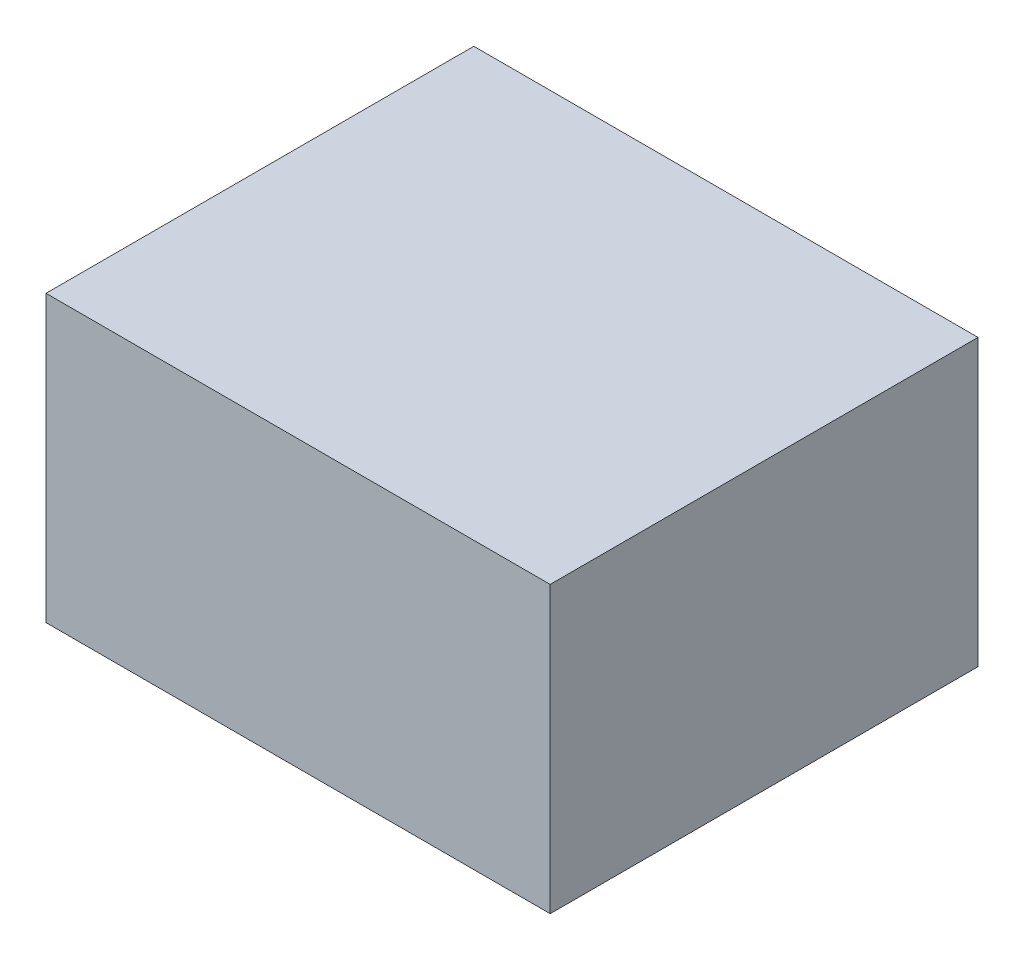
ISO-10303-21;
HEADER;
FILE_DESCRIPTION(('STEP AP214'),'2;1');
FILE_NAME('part.step','',(''),(''),'','','');
FILE_SCHEMA(('AUTOMOTIVE_DESIGN { 1 0 10303 214 1 1 1 1 }'));
ENDSEC;
DATA;
#1=APPLICATION_CONTEXT('core data for automotive mechanical design processes');
#2=APPLICATION_PROTOCOL_DEFINITION('international standard','automotive_design',2000,#1);
#3=PRODUCT_CONTEXT('',#1,'mechanical');
#4=PRODUCT('Part','Part','',(#3));
#5=PRODUCT_RELATED_PRODUCT_CATEGORY('part','',(#4));
#6=PRODUCT_DEFINITION_FORMATION('','',#4);
#7=PRODUCT_DEFINITION_CONTEXT('part definition',#1,'design');
#8=PRODUCT_DEFINITION('design','',#6,#7);
#9=PRODUCT_DEFINITION_SHAPE('','',#8);
#10=(LENGTH_UNIT() NAMED_UNIT(*) SI_UNIT(.MILLI.,.METRE.));
#11=(NAMED_UNIT(*) PLANE_ANGLE_UNIT() SI_UNIT($,.RADIAN.));
#12=(NAMED_UNIT(*) SI_UNIT($,.STERADIAN.) SOLID_ANGLE_UNIT());
#13=UNCERTAINTY_MEASURE_WITH_UNIT(LENGTH_MEASURE(1.E-05),#10,'distance_accuracy_value','');
#14=(GEOMETRIC_REPRESENTATION_CONTEXT(3) GLOBAL_UNCERTAINTY_ASSIGNED_CONTEXT((#13)) GLOBAL_UNIT_ASSIGNED_CONTEXT((#10,
#11,#12)) REPRESENTATION_CONTEXT('',''));
#15=CARTESIAN_POINT('',(0.,0.,0.));
#16=DIRECTION('',(0.,0.,1.));
#17=DIRECTION('',(1.,0.,0.));
#18=AXIS2_PLACEMENT_3D('',#15,#16,#17);
#19=CARTESIAN_POINT('',(0.,0.,4.65));
#20=DIRECTION('',(0.,0.,1.));
#21=DIRECTION('',(1.,0.,0.));
#22=AXIS2_PLACEMENT_3D('',#19,#20,#21);
#23=PLANE('',#22);
#24=DIRECTION('',(1.,0.,0.));
#25=VECTOR('',#24,1.);
#26=CARTESIAN_POINT('',(-2.74,-1.55,4.65));
#27=LINE('',#26,#25);
#28=CARTESIAN_POINT('',(-2.74,-1.55,4.65));
#29=VERTEX_POINT('',#28);
#30=CARTESIAN_POINT('',(2.74,-1.55,4.65));
#31=VERTEX_POINT('',#30);
#32=EDGE_CURVE('E93',#29,#31,#27,.T.);
#33=ORIENTED_EDGE('',*,*,#32,.T.);
#34=DIRECTION('',(0.,1.,0.));
#35=VECTOR('',#34,1.);
#36=CARTESIAN_POINT('',(2.74,-1.55,4.65));
#37=LINE('',#36,#35);
#38=CARTESIAN_POINT('',(2.74,1.55,4.65));
#39=VERTEX_POINT('',#38);
#40=EDGE_CURVE('E72',#31,#39,#37,.T.);
#41=ORIENTED_EDGE('',*,*,#40,.T.);
#42=DIRECTION('',(-1.,0.,0.));
#43=VECTOR('',#42,1.);
#44=CARTESIAN_POINT('',(2.74,1.55,4.65));
#45=LINE('',#44,#43);
#46=CARTESIAN_POINT('',(-2.74,1.55,4.65));
#47=VERTEX_POINT('',#46);
#48=EDGE_CURVE('E21',#39,#47,#45,.T.);
#49=ORIENTED_EDGE('',*,*,#48,.T.);
#50=DIRECTION('',(0.,-1.,0.));
#51=VECTOR('',#50,1.);
#52=CARTESIAN_POINT('',(-2.74,1.55,4.65));
#53=LINE('',#52,#51);
#54=EDGE_CURVE('E11',#47,#29,#53,.T.);
#55=ORIENTED_EDGE('',*,*,#54,.T.);
#56=EDGE_LOOP('',(#33,#41,#49,#55));
#57=FACE_BOUND('',#56,.T.);
#58=ADVANCED_FACE('F17',(#57),#23,.T.);
#59=CARTESIAN_POINT('',(0.,0.,0.));
#60=DIRECTION('',(0.,0.,1.));
#61=DIRECTION('',(1.,0.,0.));
#62=AXIS2_PLACEMENT_3D('',#59,#60,#61);
#63=PLANE('',#62);
#64=DIRECTION('',(0.,-1.,0.));
#65=VECTOR('',#64,1.);
#66=CARTESIAN_POINT('',(-2.74,1.55,0.));
#67=LINE('',#66,#65);
#68=CARTESIAN_POINT('',(-2.74,1.55,0.));
#69=VERTEX_POINT('',#68);
#70=CARTESIAN_POINT('',(-2.74,-1.55,0.));
#71=VERTEX_POINT('',#70);
#72=EDGE_CURVE('E27',#69,#71,#67,.T.);
#73=ORIENTED_EDGE('',*,*,#72,.F.);
#74=DIRECTION('',(-1.,0.,0.));
#75=VECTOR('',#74,1.);
#76=CARTESIAN_POINT('',(2.74,1.55,0.));
#77=LINE('',#76,#75);
#78=CARTESIAN_POINT('',(2.74,1.55,0.));
#79=VERTEX_POINT('',#78);
#80=EDGE_CURVE('E62',#79,#69,#77,.T.);
#81=ORIENTED_EDGE('',*,*,#80,.F.);
#82=DIRECTION('',(0.,1.,0.));
#83=VECTOR('',#82,1.);
#84=CARTESIAN_POINT('',(2.74,-1.55,0.));
#85=LINE('',#84,#83);
#86=CARTESIAN_POINT('',(2.74,-1.55,0.));
#87=VERTEX_POINT('',#86);
#88=EDGE_CURVE('E66',#87,#79,#85,.T.);
#89=ORIENTED_EDGE('',*,*,#88,.F.);
#90=DIRECTION('',(1.,0.,0.));
#91=VECTOR('',#90,1.);
#92=CARTESIAN_POINT('',(-2.74,-1.55,0.));
#93=LINE('',#92,#91);
#94=EDGE_CURVE('E123',#71,#87,#93,.T.);
#95=ORIENTED_EDGE('',*,*,#94,.F.);
#96=EDGE_LOOP('',(#73,#81,#89,#95));
#97=FACE_BOUND('',#96,.T.);
#98=ADVANCED_FACE('F19',(#97),#63,.F.);
#99=CARTESIAN_POINT('',(-2.74,1.55,0.));
#100=DIRECTION('',(1.,0.,0.));
#101=DIRECTION('',(0.,1.,0.));
#102=AXIS2_PLACEMENT_3D('',#99,#100,#101);
#103=PLANE('',#102);
#104=ORIENTED_EDGE('',*,*,#72,.T.);
#105=DIRECTION('',(0.,0.,1.));
#106=VECTOR('',#105,1.);
#107=CARTESIAN_POINT('',(-2.74,-1.55,0.));
#108=LINE('',#107,#106);
#109=EDGE_CURVE('E87',#71,#29,#108,.T.);
#110=ORIENTED_EDGE('',*,*,#109,.T.);
#111=ORIENTED_EDGE('',*,*,#54,.F.);
#112=DIRECTION('',(0.,0.,1.));
#113=VECTOR('',#112,1.);
#114=CARTESIAN_POINT('',(-2.74,1.55,0.));
#115=LINE('',#114,#113);
#116=EDGE_CURVE('E71',#69,#47,#115,.T.);
#117=ORIENTED_EDGE('',*,*,#116,.F.);
#118=EDGE_LOOP('',(#104,#110,#111,#117));
#119=FACE_BOUND('',#118,.T.);
#120=ADVANCED_FACE('F120',(#119),#103,.F.);
#121=CARTESIAN_POINT('',(2.74,1.55,0.));
#122=DIRECTION('',(0.,-1.,0.));
#123=DIRECTION('',(0.,0.,-1.));
#124=AXIS2_PLACEMENT_3D('',#121,#122,#123);
#125=PLANE('',#124);
#126=ORIENTED_EDGE('',*,*,#80,.T.);
#127=ORIENTED_EDGE('',*,*,#116,.T.);
#128=ORIENTED_EDGE('',*,*,#48,.F.);
#129=DIRECTION('',(0.,0.,1.));
#130=VECTOR('',#129,1.);
#131=CARTESIAN_POINT('',(2.74,1.55,0.));
#132=LINE('',#131,#130);
#133=EDGE_CURVE('E75',#79,#39,#132,.T.);
#134=ORIENTED_EDGE('',*,*,#133,.F.);
#135=EDGE_LOOP('',(#126,#127,#128,#134));
#136=FACE_BOUND('',#135,.T.);
#137=ADVANCED_FACE('F76',(#136),#125,.F.);
#138=CARTESIAN_POINT('',(2.74,-1.55,0.));
#139=DIRECTION('',(-1.,0.,0.));
#140=DIRECTION('',(0.,0.,1.));
#141=AXIS2_PLACEMENT_3D('',#138,#139,#140);
#142=PLANE('',#141);
#143=ORIENTED_EDGE('',*,*,#88,.T.);
#144=ORIENTED_EDGE('',*,*,#133,.T.);
#145=ORIENTED_EDGE('',*,*,#40,.F.);
#146=DIRECTION('',(0.,0.,1.));
#147=VECTOR('',#146,1.);
#148=CARTESIAN_POINT('',(2.74,-1.55,0.));
#149=LINE('',#148,#147);
#150=EDGE_CURVE('E84',#87,#31,#149,.T.);
#151=ORIENTED_EDGE('',*,*,#150,.F.);
#152=EDGE_LOOP('',(#143,#144,#145,#151));
#153=FACE_BOUND('',#152,.T.);
#154=ADVANCED_FACE('F82',(#153),#142,.F.);
#155=CARTESIAN_POINT('',(-2.74,-1.55,0.));
#156=DIRECTION('',(0.,1.,0.));
#157=DIRECTION('',(1.,0.,0.));
#158=AXIS2_PLACEMENT_3D('',#155,#156,#157);
#159=PLANE('',#158);
#160=ORIENTED_EDGE('',*,*,#94,.T.);
#161=ORIENTED_EDGE('',*,*,#150,.T.);
#162=ORIENTED_EDGE('',*,*,#32,.F.);
#163=ORIENTED_EDGE('',*,*,#109,.F.);
#164=EDGE_LOOP('',(#160,#161,#162,#163));
#165=FACE_BOUND('',#164,.T.);
#166=ADVANCED_FACE('F122',(#165),#159,.F.);
#167=CLOSED_SHELL('',(#58,#98,#120,#137,#154,#166));
#168=MANIFOLD_SOLID_BREP('B1',#167);
#169=ADVANCED_BREP_SHAPE_REPRESENTATION('',(#18,#168),#14);
#170=SHAPE_DEFINITION_REPRESENTATION(#9,#169);
ENDSEC;
END-ISO-10303-21;
